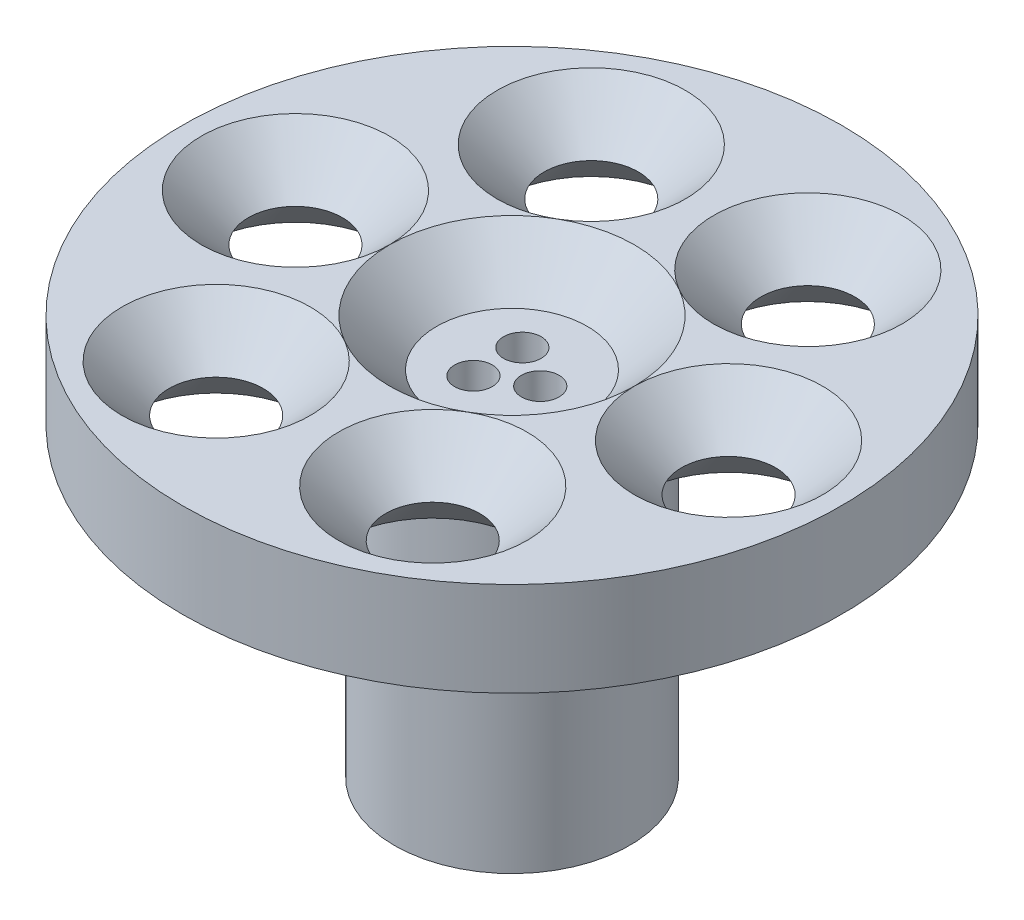
ISO-10303-21;
HEADER;
FILE_DESCRIPTION(('STEP AP214'),'2;1');
FILE_NAME('part.step','',(''),(''),'','','');
FILE_SCHEMA(('AUTOMOTIVE_DESIGN { 1 0 10303 214 1 1 1 1 }'));
ENDSEC;
DATA;
#1=APPLICATION_CONTEXT('core data for automotive mechanical design processes');
#2=APPLICATION_PROTOCOL_DEFINITION('international standard','automotive_design',2000,#1);
#3=PRODUCT_CONTEXT('',#1,'mechanical');
#4=PRODUCT('Part','Part','',(#3));
#5=PRODUCT_RELATED_PRODUCT_CATEGORY('part','',(#4));
#6=PRODUCT_DEFINITION_FORMATION('','',#4);
#7=PRODUCT_DEFINITION_CONTEXT('part definition',#1,'design');
#8=PRODUCT_DEFINITION('design','',#6,#7);
#9=PRODUCT_DEFINITION_SHAPE('','',#8);
#10=(LENGTH_UNIT() NAMED_UNIT(*) SI_UNIT(.MILLI.,.METRE.));
#11=(NAMED_UNIT(*) PLANE_ANGLE_UNIT() SI_UNIT($,.RADIAN.));
#12=(NAMED_UNIT(*) SI_UNIT($,.STERADIAN.) SOLID_ANGLE_UNIT());
#13=UNCERTAINTY_MEASURE_WITH_UNIT(LENGTH_MEASURE(1.E-05),#10,'distance_accuracy_value','');
#14=(GEOMETRIC_REPRESENTATION_CONTEXT(3) GLOBAL_UNCERTAINTY_ASSIGNED_CONTEXT((#13)) GLOBAL_UNIT_ASSIGNED_CONTEXT((#10,
#11,#12)) REPRESENTATION_CONTEXT('',''));
#15=CARTESIAN_POINT('',(0.,0.,0.));
#16=DIRECTION('',(0.,0.,1.));
#17=DIRECTION('',(1.,0.,0.));
#18=AXIS2_PLACEMENT_3D('',#15,#16,#17);
#19=CARTESIAN_POINT('',(-1.50000000000001,42.5,2.59807621135331));
#20=DIRECTION('',(0.,-1.,0.));
#21=DIRECTION('',(0.,0.,-1.));
#22=AXIS2_PLACEMENT_3D('',#19,#20,#21);
#23=CYLINDRICAL_SURFACE('',#22,2.);
#24=CARTESIAN_POINT('',(-1.50000000000001,1.5,2.59807621135331));
#25=DIRECTION('',(0.,-1.,0.));
#26=DIRECTION('',(0.,0.,-1.));
#27=AXIS2_PLACEMENT_3D('',#24,#25,#26);
#28=CIRCLE('',#27,2.);
#29=CARTESIAN_POINT('',(-1.50000000000001,1.5,0.598076211353308));
#30=VERTEX_POINT('',#29);
#31=EDGE_CURVE('E154',#30,#30,#28,.T.);
#32=ORIENTED_EDGE('',*,*,#31,.T.);
#33=EDGE_LOOP('',(#32));
#34=FACE_BOUND('',#33,.T.);
#35=CARTESIAN_POINT('',(-1.50000000000001,37.5,2.59807621135331));
#36=DIRECTION('',(0.,1.,0.));
#37=DIRECTION('',(0.,0.,1.));
#38=AXIS2_PLACEMENT_3D('',#35,#36,#37);
#39=CIRCLE('',#38,2.);
#40=CARTESIAN_POINT('',(-1.50000000000001,37.5,4.59807621135331));
#41=VERTEX_POINT('',#40);
#42=EDGE_CURVE('E130',#41,#41,#39,.F.);
#43=ORIENTED_EDGE('',*,*,#42,.F.);
#44=EDGE_LOOP('',(#43));
#45=FACE_BOUND('',#44,.T.);
#46=ADVANCED_FACE('F40',(#34,#45),#23,.F.);
#47=CARTESIAN_POINT('',(3.,42.5,0.));
#48=DIRECTION('',(0.,-1.,0.));
#49=DIRECTION('',(0.,0.,-1.));
#50=AXIS2_PLACEMENT_3D('',#47,#48,#49);
#51=CYLINDRICAL_SURFACE('',#50,2.);
#52=CARTESIAN_POINT('',(3.,1.5,0.));
#53=DIRECTION('',(0.,-1.,0.));
#54=DIRECTION('',(0.,0.,-1.));
#55=AXIS2_PLACEMENT_3D('',#52,#53,#54);
#56=CIRCLE('',#55,2.);
#57=CARTESIAN_POINT('',(3.,1.5,-2.));
#58=VERTEX_POINT('',#57);
#59=EDGE_CURVE('E151',#58,#58,#56,.T.);
#60=ORIENTED_EDGE('',*,*,#59,.T.);
#61=EDGE_LOOP('',(#60));
#62=FACE_BOUND('',#61,.T.);
#63=CARTESIAN_POINT('',(3.,37.5,0.));
#64=DIRECTION('',(0.,1.,0.));
#65=DIRECTION('',(0.,0.,1.));
#66=AXIS2_PLACEMENT_3D('',#63,#64,#65);
#67=CIRCLE('',#66,2.);
#68=CARTESIAN_POINT('',(3.,37.5,2.));
#69=VERTEX_POINT('',#68);
#70=EDGE_CURVE('E126',#69,#69,#67,.F.);
#71=ORIENTED_EDGE('',*,*,#70,.F.);
#72=EDGE_LOOP('',(#71));
#73=FACE_BOUND('',#72,.T.);
#74=ADVANCED_FACE('F204',(#62,#73),#51,.F.);
#75=CARTESIAN_POINT('',(-1.49999999999998,42.5,-2.59807621135333));
#76=DIRECTION('',(0.,-1.,0.));
#77=DIRECTION('',(0.,0.,-1.));
#78=AXIS2_PLACEMENT_3D('',#75,#76,#77);
#79=CYLINDRICAL_SURFACE('',#78,2.);
#80=CARTESIAN_POINT('',(-1.49999999999998,1.5,-2.59807621135333));
#81=DIRECTION('',(0.,-1.,0.));
#82=DIRECTION('',(0.,0.,-1.));
#83=AXIS2_PLACEMENT_3D('',#80,#81,#82);
#84=CIRCLE('',#83,2.);
#85=CARTESIAN_POINT('',(-1.49999999999998,1.5,-4.59807621135333));
#86=VERTEX_POINT('',#85);
#87=EDGE_CURVE('E148',#86,#86,#84,.T.);
#88=ORIENTED_EDGE('',*,*,#87,.T.);
#89=EDGE_LOOP('',(#88));
#90=FACE_BOUND('',#89,.T.);
#91=CARTESIAN_POINT('',(-1.49999999999998,37.5,-2.59807621135333));
#92=DIRECTION('',(0.,1.,0.));
#93=DIRECTION('',(0.,0.,1.));
#94=AXIS2_PLACEMENT_3D('',#91,#92,#93);
#95=CIRCLE('',#94,2.);
#96=CARTESIAN_POINT('',(-1.49999999999998,37.5,-0.59807621135333));
#97=VERTEX_POINT('',#96);
#98=EDGE_CURVE('E135',#97,#97,#95,.F.);
#99=ORIENTED_EDGE('',*,*,#98,.F.);
#100=EDGE_LOOP('',(#99));
#101=FACE_BOUND('',#100,.T.);
#102=ADVANCED_FACE('F210',(#90,#101),#79,.F.);
#103=CARTESIAN_POINT('',(0.,42.5,0.));
#104=DIRECTION('',(0.,-1.,0.));
#105=DIRECTION('',(0.,0.,-1.));
#106=AXIS2_PLACEMENT_3D('',#103,#104,#105);
#107=CYLINDRICAL_SURFACE('',#106,12.5);
#108=CARTESIAN_POINT('',(0.,0.,0.));
#109=DIRECTION('',(0.,1.,0.));
#110=DIRECTION('',(0.,0.,1.));
#111=AXIS2_PLACEMENT_3D('',#108,#109,#110);
#112=CIRCLE('',#111,12.5);
#113=CARTESIAN_POINT('',(0.,0.,12.5));
#114=VERTEX_POINT('',#113);
#115=EDGE_CURVE('E157',#114,#114,#112,.T.);
#116=ORIENTED_EDGE('',*,*,#115,.T.);
#117=EDGE_LOOP('',(#116));
#118=FACE_BOUND('',#117,.T.);
#119=CARTESIAN_POINT('',(0.,32.5,0.));
#120=DIRECTION('',(0.,1.,0.));
#121=DIRECTION('',(0.,0.,1.));
#122=AXIS2_PLACEMENT_3D('',#119,#120,#121);
#123=CIRCLE('',#122,12.5);
#124=CARTESIAN_POINT('',(0.,32.5,12.5));
#125=VERTEX_POINT('',#124);
#126=EDGE_CURVE('E160',#125,#125,#123,.T.);
#127=ORIENTED_EDGE('',*,*,#126,.F.);
#128=EDGE_LOOP('',(#127));
#129=FACE_BOUND('',#128,.T.);
#130=ADVANCED_FACE('F215',(#118,#129),#107,.T.);
#131=CARTESIAN_POINT('',(0.,42.5,0.));
#132=DIRECTION('',(0.,1.,0.));
#133=DIRECTION('',(0.,0.,1.));
#134=AXIS2_PLACEMENT_3D('',#131,#132,#133);
#135=PLANE('',#134);
#136=CARTESIAN_POINT('',(-11.5,42.5,19.9185842870421));
#137=DIRECTION('',(0.,1.,0.));
#138=DIRECTION('',(0.,0.,1.));
#139=AXIS2_PLACEMENT_3D('',#136,#137,#138);
#140=CIRCLE('',#139,10.);
#141=CARTESIAN_POINT('',(-6.49999999999998,42.5,11.2583302491977));
#142=VERTEX_POINT('',#141);
#143=EDGE_CURVE('E78',#142,#142,#140,.F.);
#144=ORIENTED_EDGE('',*,*,#143,.T.);
#145=CARTESIAN_POINT('',(0.,42.5,0.));
#146=DIRECTION('',(0.,1.,0.));
#147=DIRECTION('',(0.,0.,1.));
#148=AXIS2_PLACEMENT_3D('',#145,#146,#147);
#149=CIRCLE('',#148,13.);
#150=CARTESIAN_POINT('',(-13.,42.5,0.));
#151=VERTEX_POINT('',#150);
#152=EDGE_CURVE('E11',#142,#151,#149,.F.);
#153=ORIENTED_EDGE('',*,*,#152,.T.);
#154=CARTESIAN_POINT('',(-23.,42.5,0.));
#155=DIRECTION('',(0.,1.,0.));
#156=DIRECTION('',(0.,0.,1.));
#157=AXIS2_PLACEMENT_3D('',#154,#155,#156);
#158=CIRCLE('',#157,10.);
#159=EDGE_CURVE('E183',#151,#151,#158,.F.);
#160=ORIENTED_EDGE('',*,*,#159,.T.);
#161=CARTESIAN_POINT('',(0.,42.5,0.));
#162=DIRECTION('',(0.,1.,0.));
#163=DIRECTION('',(0.,0.,1.));
#164=AXIS2_PLACEMENT_3D('',#161,#162,#163);
#165=CIRCLE('',#164,13.);
#166=CARTESIAN_POINT('',(-6.5,42.5,-11.2583302491977));
#167=VERTEX_POINT('',#166);
#168=EDGE_CURVE('E49',#151,#167,#165,.F.);
#169=ORIENTED_EDGE('',*,*,#168,.T.);
#170=CARTESIAN_POINT('',(-11.5,42.5,-19.9185842870421));
#171=DIRECTION('',(0.,1.,0.));
#172=DIRECTION('',(0.,0.,1.));
#173=AXIS2_PLACEMENT_3D('',#170,#171,#172);
#174=CIRCLE('',#173,10.);
#175=EDGE_CURVE('E97',#167,#167,#174,.F.);
#176=ORIENTED_EDGE('',*,*,#175,.T.);
#177=CARTESIAN_POINT('',(0.,42.5,0.));
#178=DIRECTION('',(0.,1.,0.));
#179=DIRECTION('',(0.,0.,1.));
#180=AXIS2_PLACEMENT_3D('',#177,#178,#179);
#181=CIRCLE('',#180,13.);
#182=CARTESIAN_POINT('',(6.49999999999999,42.5,-11.2583302491977));
#183=VERTEX_POINT('',#182);
#184=EDGE_CURVE('E92',#167,#183,#181,.F.);
#185=ORIENTED_EDGE('',*,*,#184,.T.);
#186=CARTESIAN_POINT('',(11.5,42.5,-19.9185842870421));
#187=DIRECTION('',(0.,1.,0.));
#188=DIRECTION('',(0.,0.,1.));
#189=AXIS2_PLACEMENT_3D('',#186,#187,#188);
#190=CIRCLE('',#189,10.);
#191=EDGE_CURVE('E95',#183,#183,#190,.F.);
#192=ORIENTED_EDGE('',*,*,#191,.T.);
#193=CARTESIAN_POINT('',(0.,42.5,0.));
#194=DIRECTION('',(0.,1.,0.));
#195=DIRECTION('',(0.,0.,1.));
#196=AXIS2_PLACEMENT_3D('',#193,#194,#195);
#197=CIRCLE('',#196,13.);
#198=CARTESIAN_POINT('',(13.,42.5,0.));
#199=VERTEX_POINT('',#198);
#200=EDGE_CURVE('E84',#183,#199,#197,.F.);
#201=ORIENTED_EDGE('',*,*,#200,.T.);
#202=CARTESIAN_POINT('',(23.,42.5,0.));
#203=DIRECTION('',(0.,1.,0.));
#204=DIRECTION('',(0.,0.,1.));
#205=AXIS2_PLACEMENT_3D('',#202,#203,#204);
#206=CIRCLE('',#205,10.);
#207=EDGE_CURVE('E102',#199,#199,#206,.F.);
#208=ORIENTED_EDGE('',*,*,#207,.T.);
#209=CARTESIAN_POINT('',(0.,42.5,0.));
#210=DIRECTION('',(0.,1.,0.));
#211=DIRECTION('',(0.,0.,1.));
#212=AXIS2_PLACEMENT_3D('',#209,#210,#211);
#213=CIRCLE('',#212,13.);
#214=CARTESIAN_POINT('',(6.5,42.5,11.2583302491977));
#215=VERTEX_POINT('',#214);
#216=EDGE_CURVE('E82',#199,#215,#213,.F.);
#217=ORIENTED_EDGE('',*,*,#216,.T.);
#218=CARTESIAN_POINT('',(11.5,42.5,19.9185842870421));
#219=DIRECTION('',(0.,1.,0.));
#220=DIRECTION('',(0.,0.,1.));
#221=AXIS2_PLACEMENT_3D('',#218,#219,#220);
#222=CIRCLE('',#221,10.);
#223=EDGE_CURVE('E80',#215,#215,#222,.F.);
#224=ORIENTED_EDGE('',*,*,#223,.T.);
#225=CARTESIAN_POINT('',(0.,42.5,0.));
#226=DIRECTION('',(0.,1.,0.));
#227=DIRECTION('',(0.,0.,1.));
#228=AXIS2_PLACEMENT_3D('',#225,#226,#227);
#229=CIRCLE('',#228,13.);
#230=EDGE_CURVE('E74',#215,#142,#229,.F.);
#231=ORIENTED_EDGE('',*,*,#230,.T.);
#232=EDGE_LOOP('',(#144,#153,#160,#169,#176,#185,#192,#201,#208,#217,#224,#231));
#233=FACE_BOUND('',#232,.T.);
#234=CARTESIAN_POINT('',(0.,42.5,0.));
#235=DIRECTION('',(0.,1.,0.));
#236=DIRECTION('',(0.,0.,1.));
#237=AXIS2_PLACEMENT_3D('',#234,#235,#236);
#238=CIRCLE('',#237,35.);
#239=CARTESIAN_POINT('',(0.,42.5,35.));
#240=VERTEX_POINT('',#239);
#241=EDGE_CURVE('E112',#240,#240,#238,.T.);
#242=ORIENTED_EDGE('',*,*,#241,.T.);
#243=EDGE_LOOP('',(#242));
#244=FACE_BOUND('',#243,.T.);
#245=ADVANCED_FACE('F75',(#233,#244),#135,.T.);
#246=CARTESIAN_POINT('',(0.,0.,0.));
#247=DIRECTION('',(0.,1.,0.));
#248=DIRECTION('',(0.,0.,1.));
#249=AXIS2_PLACEMENT_3D('',#246,#247,#248);
#250=PLANE('',#249);
#251=CARTESIAN_POINT('',(0.,0.,0.));
#252=DIRECTION('',(0.,-1.,0.));
#253=DIRECTION('',(0.,0.,-1.));
#254=AXIS2_PLACEMENT_3D('',#251,#252,#253);
#255=CIRCLE('',#254,5.5);
#256=CARTESIAN_POINT('',(0.,0.,-5.5));
#257=VERTEX_POINT('',#256);
#258=EDGE_CURVE('E142',#257,#257,#255,.T.);
#259=ORIENTED_EDGE('',*,*,#258,.F.);
#260=EDGE_LOOP('',(#259));
#261=FACE_BOUND('',#260,.T.);
#262=ORIENTED_EDGE('',*,*,#115,.F.);
#263=EDGE_LOOP('',(#262));
#264=FACE_BOUND('',#263,.T.);
#265=ADVANCED_FACE('F312',(#261,#264),#250,.F.);
#266=CARTESIAN_POINT('',(0.,1.5,0.));
#267=DIRECTION('',(0.,-1.,0.));
#268=DIRECTION('',(0.,0.,-1.));
#269=AXIS2_PLACEMENT_3D('',#266,#267,#268);
#270=CYLINDRICAL_SURFACE('',#269,5.5);
#271=CARTESIAN_POINT('',(0.,1.5,0.));
#272=DIRECTION('',(0.,-1.,0.));
#273=DIRECTION('',(0.,0.,-1.));
#274=AXIS2_PLACEMENT_3D('',#271,#272,#273);
#275=CIRCLE('',#274,5.5);
#276=CARTESIAN_POINT('',(0.,1.5,-5.5));
#277=VERTEX_POINT('',#276);
#278=EDGE_CURVE('E145',#277,#277,#275,.T.);
#279=ORIENTED_EDGE('',*,*,#278,.F.);
#280=EDGE_LOOP('',(#279));
#281=FACE_BOUND('',#280,.T.);
#282=ORIENTED_EDGE('',*,*,#258,.T.);
#283=EDGE_LOOP('',(#282));
#284=FACE_BOUND('',#283,.T.);
#285=ADVANCED_FACE('F318',(#281,#284),#270,.F.);
#286=CARTESIAN_POINT('',(0.,1.5,0.));
#287=DIRECTION('',(0.,-1.,0.));
#288=DIRECTION('',(0.,0.,-1.));
#289=AXIS2_PLACEMENT_3D('',#286,#287,#288);
#290=PLANE('',#289);
#291=ORIENTED_EDGE('',*,*,#31,.F.);
#292=EDGE_LOOP('',(#291));
#293=FACE_BOUND('',#292,.T.);
#294=ORIENTED_EDGE('',*,*,#59,.F.);
#295=EDGE_LOOP('',(#294));
#296=FACE_BOUND('',#295,.T.);
#297=ORIENTED_EDGE('',*,*,#87,.F.);
#298=EDGE_LOOP('',(#297));
#299=FACE_BOUND('',#298,.T.);
#300=ORIENTED_EDGE('',*,*,#278,.T.);
#301=EDGE_LOOP('',(#300));
#302=FACE_BOUND('',#301,.T.);
#303=ADVANCED_FACE('F308',(#293,#296,#299,#302),#290,.T.);
#304=CARTESIAN_POINT('',(0.,32.5,0.));
#305=DIRECTION('',(0.,1.,0.));
#306=DIRECTION('',(0.,0.,1.));
#307=AXIS2_PLACEMENT_3D('',#304,#305,#306);
#308=CYLINDRICAL_SURFACE('',#307,35.);
#309=CARTESIAN_POINT('',(0.,32.5,0.));
#310=DIRECTION('',(0.,1.,0.));
#311=DIRECTION('',(0.,0.,1.));
#312=AXIS2_PLACEMENT_3D('',#309,#310,#311);
#313=CIRCLE('',#312,35.);
#314=CARTESIAN_POINT('',(0.,32.5,35.));
#315=VERTEX_POINT('',#314);
#316=EDGE_CURVE('E139',#315,#315,#313,.T.);
#317=ORIENTED_EDGE('',*,*,#316,.T.);
#318=EDGE_LOOP('',(#317));
#319=FACE_BOUND('',#318,.T.);
#320=ORIENTED_EDGE('',*,*,#241,.F.);
#321=EDGE_LOOP('',(#320));
#322=FACE_BOUND('',#321,.T.);
#323=ADVANCED_FACE('F299',(#319,#322),#308,.T.);
#324=CARTESIAN_POINT('',(0.,32.5,0.));
#325=DIRECTION('',(0.,1.,0.));
#326=DIRECTION('',(0.,0.,1.));
#327=AXIS2_PLACEMENT_3D('',#324,#325,#326);
#328=PLANE('',#327);
#329=CARTESIAN_POINT('',(11.5,32.5,19.9185842870421));
#330=DIRECTION('',(0.,1.,0.));
#331=DIRECTION('',(0.,0.,1.));
#332=AXIS2_PLACEMENT_3D('',#329,#330,#331);
#333=CIRCLE('',#332,10.);
#334=CARTESIAN_POINT('',(11.5,32.5,29.9185842870421));
#335=VERTEX_POINT('',#334);
#336=EDGE_CURVE('E180',#335,#335,#333,.T.);
#337=ORIENTED_EDGE('',*,*,#336,.T.);
#338=EDGE_LOOP('',(#337));
#339=FACE_BOUND('',#338,.T.);
#340=CARTESIAN_POINT('',(23.,32.5,0.));
#341=DIRECTION('',(0.,1.,0.));
#342=DIRECTION('',(0.,0.,1.));
#343=AXIS2_PLACEMENT_3D('',#340,#341,#342);
#344=CIRCLE('',#343,10.);
#345=CARTESIAN_POINT('',(23.,32.5,10.));
#346=VERTEX_POINT('',#345);
#347=EDGE_CURVE('E177',#346,#346,#344,.T.);
#348=ORIENTED_EDGE('',*,*,#347,.T.);
#349=EDGE_LOOP('',(#348));
#350=FACE_BOUND('',#349,.T.);
#351=CARTESIAN_POINT('',(11.5,32.5,-19.9185842870421));
#352=DIRECTION('',(0.,1.,0.));
#353=DIRECTION('',(0.,0.,1.));
#354=AXIS2_PLACEMENT_3D('',#351,#352,#353);
#355=CIRCLE('',#354,10.);
#356=CARTESIAN_POINT('',(11.5,32.5,-9.91858428704209));
#357=VERTEX_POINT('',#356);
#358=EDGE_CURVE('E174',#357,#357,#355,.T.);
#359=ORIENTED_EDGE('',*,*,#358,.T.);
#360=EDGE_LOOP('',(#359));
#361=FACE_BOUND('',#360,.T.);
#362=CARTESIAN_POINT('',(-11.5,32.5,-19.9185842870421));
#363=DIRECTION('',(0.,1.,0.));
#364=DIRECTION('',(0.,0.,1.));
#365=AXIS2_PLACEMENT_3D('',#362,#363,#364);
#366=CIRCLE('',#365,10.);
#367=CARTESIAN_POINT('',(-11.5,32.5,-9.91858428704208));
#368=VERTEX_POINT('',#367);
#369=EDGE_CURVE('E171',#368,#368,#366,.T.);
#370=ORIENTED_EDGE('',*,*,#369,.T.);
#371=EDGE_LOOP('',(#370));
#372=FACE_BOUND('',#371,.T.);
#373=CARTESIAN_POINT('',(-23.,32.5,0.));
#374=DIRECTION('',(0.,1.,0.));
#375=DIRECTION('',(0.,0.,1.));
#376=AXIS2_PLACEMENT_3D('',#373,#374,#375);
#377=CIRCLE('',#376,10.);
#378=CARTESIAN_POINT('',(-23.,32.5,10.));
#379=VERTEX_POINT('',#378);
#380=EDGE_CURVE('E168',#379,#379,#377,.T.);
#381=ORIENTED_EDGE('',*,*,#380,.T.);
#382=EDGE_LOOP('',(#381));
#383=FACE_BOUND('',#382,.T.);
#384=CARTESIAN_POINT('',(-11.5,32.5,19.9185842870421));
#385=DIRECTION('',(0.,1.,0.));
#386=DIRECTION('',(0.,0.,1.));
#387=AXIS2_PLACEMENT_3D('',#384,#385,#386);
#388=CIRCLE('',#387,10.);
#389=CARTESIAN_POINT('',(-11.5,32.5,29.9185842870421));
#390=VERTEX_POINT('',#389);
#391=EDGE_CURVE('E165',#390,#390,#388,.T.);
#392=ORIENTED_EDGE('',*,*,#391,.T.);
#393=EDGE_LOOP('',(#392));
#394=FACE_BOUND('',#393,.T.);
#395=ORIENTED_EDGE('',*,*,#126,.T.);
#396=EDGE_LOOP('',(#395));
#397=FACE_BOUND('',#396,.T.);
#398=ORIENTED_EDGE('',*,*,#316,.F.);
#399=EDGE_LOOP('',(#398));
#400=FACE_BOUND('',#399,.T.);
#401=ADVANCED_FACE('F236',(#339,#350,#361,#372,#383,#394,#397,#400),#328,.F.);
#402=CARTESIAN_POINT('',(11.5,37.5,19.9185842870421));
#403=DIRECTION('',(0.,1.,0.));
#404=DIRECTION('',(0.,0.,1.));
#405=AXIS2_PLACEMENT_3D('',#402,#403,#404);
#406=CONICAL_SURFACE('',#405,5.,0.785398163397451);
#407=ORIENTED_EDGE('',*,*,#223,.F.);
#408=EDGE_LOOP('',(#407));
#409=FACE_BOUND('',#408,.T.);
#410=CARTESIAN_POINT('',(11.5,37.5,19.9185842870421));
#411=DIRECTION('',(0.,1.,0.));
#412=DIRECTION('',(0.,0.,1.));
#413=AXIS2_PLACEMENT_3D('',#410,#411,#412);
#414=CIRCLE('',#413,5.);
#415=CARTESIAN_POINT('',(11.5,37.5,24.9185842870421));
#416=VERTEX_POINT('',#415);
#417=EDGE_CURVE('E109',#416,#416,#414,.T.);
#418=ORIENTED_EDGE('',*,*,#417,.F.);
#419=EDGE_LOOP('',(#418));
#420=FACE_BOUND('',#419,.T.);
#421=ADVANCED_FACE('F230',(#409,#420),#406,.F.);
#422=CARTESIAN_POINT('',(11.5,32.5,19.9185842870421));
#423=DIRECTION('',(0.,-1.,0.));
#424=DIRECTION('',(0.,0.,-1.));
#425=AXIS2_PLACEMENT_3D('',#422,#423,#424);
#426=CONICAL_SURFACE('',#425,10.,0.785398163397447);
#427=ORIENTED_EDGE('',*,*,#417,.T.);
#428=EDGE_LOOP('',(#427));
#429=FACE_BOUND('',#428,.T.);
#430=ORIENTED_EDGE('',*,*,#336,.F.);
#431=EDGE_LOOP('',(#430));
#432=FACE_BOUND('',#431,.T.);
#433=ADVANCED_FACE('F222',(#429,#432),#426,.F.);
#434=CARTESIAN_POINT('',(23.,37.5,0.));
#435=DIRECTION('',(0.,1.,0.));
#436=DIRECTION('',(0.,0.,1.));
#437=AXIS2_PLACEMENT_3D('',#434,#435,#436);
#438=CONICAL_SURFACE('',#437,5.,0.785398163397451);
#439=ORIENTED_EDGE('',*,*,#207,.F.);
#440=EDGE_LOOP('',(#439));
#441=FACE_BOUND('',#440,.T.);
#442=CARTESIAN_POINT('',(23.,37.5,0.));
#443=DIRECTION('',(0.,1.,0.));
#444=DIRECTION('',(0.,0.,1.));
#445=AXIS2_PLACEMENT_3D('',#442,#443,#444);
#446=CIRCLE('',#445,5.);
#447=CARTESIAN_POINT('',(23.,37.5,5.));
#448=VERTEX_POINT('',#447);
#449=EDGE_CURVE('E113',#448,#448,#446,.T.);
#450=ORIENTED_EDGE('',*,*,#449,.F.);
#451=EDGE_LOOP('',(#450));
#452=FACE_BOUND('',#451,.T.);
#453=ADVANCED_FACE('F229',(#441,#452),#438,.F.);
#454=CARTESIAN_POINT('',(23.,32.5,0.));
#455=DIRECTION('',(0.,-1.,0.));
#456=DIRECTION('',(0.,0.,-1.));
#457=AXIS2_PLACEMENT_3D('',#454,#455,#456);
#458=CONICAL_SURFACE('',#457,10.,0.785398163397447);
#459=ORIENTED_EDGE('',*,*,#449,.T.);
#460=EDGE_LOOP('',(#459));
#461=FACE_BOUND('',#460,.T.);
#462=ORIENTED_EDGE('',*,*,#347,.F.);
#463=EDGE_LOOP('',(#462));
#464=FACE_BOUND('',#463,.T.);
#465=ADVANCED_FACE('F239',(#461,#464),#458,.F.);
#466=CARTESIAN_POINT('',(11.5,37.5,-19.9185842870421));
#467=DIRECTION('',(0.,1.,0.));
#468=DIRECTION('',(0.,0.,1.));
#469=AXIS2_PLACEMENT_3D('',#466,#467,#468);
#470=CONICAL_SURFACE('',#469,5.,0.785398163397451);
#471=ORIENTED_EDGE('',*,*,#191,.F.);
#472=EDGE_LOOP('',(#471));
#473=FACE_BOUND('',#472,.T.);
#474=CARTESIAN_POINT('',(11.5,37.5,-19.9185842870421));
#475=DIRECTION('',(0.,1.,0.));
#476=DIRECTION('',(0.,0.,1.));
#477=AXIS2_PLACEMENT_3D('',#474,#475,#476);
#478=CIRCLE('',#477,5.);
#479=CARTESIAN_POINT('',(11.5,37.5,-14.9185842870421));
#480=VERTEX_POINT('',#479);
#481=EDGE_CURVE('E116',#480,#480,#478,.T.);
#482=ORIENTED_EDGE('',*,*,#481,.F.);
#483=EDGE_LOOP('',(#482));
#484=FACE_BOUND('',#483,.T.);
#485=ADVANCED_FACE('F245',(#473,#484),#470,.F.);
#486=CARTESIAN_POINT('',(11.5,32.5,-19.9185842870421));
#487=DIRECTION('',(0.,-1.,0.));
#488=DIRECTION('',(0.,0.,-1.));
#489=AXIS2_PLACEMENT_3D('',#486,#487,#488);
#490=CONICAL_SURFACE('',#489,10.,0.785398163397447);
#491=ORIENTED_EDGE('',*,*,#481,.T.);
#492=EDGE_LOOP('',(#491));
#493=FACE_BOUND('',#492,.T.);
#494=ORIENTED_EDGE('',*,*,#358,.F.);
#495=EDGE_LOOP('',(#494));
#496=FACE_BOUND('',#495,.T.);
#497=ADVANCED_FACE('F252',(#493,#496),#490,.F.);
#498=CARTESIAN_POINT('',(-11.5,37.5,-19.9185842870421));
#499=DIRECTION('',(0.,1.,0.));
#500=DIRECTION('',(0.,0.,1.));
#501=AXIS2_PLACEMENT_3D('',#498,#499,#500);
#502=CONICAL_SURFACE('',#501,5.,0.785398163397451);
#503=ORIENTED_EDGE('',*,*,#175,.F.);
#504=EDGE_LOOP('',(#503));
#505=FACE_BOUND('',#504,.T.);
#506=CARTESIAN_POINT('',(-11.5,37.5,-19.9185842870421));
#507=DIRECTION('',(0.,1.,0.));
#508=DIRECTION('',(0.,0.,1.));
#509=AXIS2_PLACEMENT_3D('',#506,#507,#508);
#510=CIRCLE('',#509,5.);
#511=CARTESIAN_POINT('',(-11.5,37.5,-14.9185842870421));
#512=VERTEX_POINT('',#511);
#513=EDGE_CURVE('E119',#512,#512,#510,.T.);
#514=ORIENTED_EDGE('',*,*,#513,.F.);
#515=EDGE_LOOP('',(#514));
#516=FACE_BOUND('',#515,.T.);
#517=ADVANCED_FACE('F198',(#505,#516),#502,.F.);
#518=CARTESIAN_POINT('',(-11.5,32.5,-19.9185842870421));
#519=DIRECTION('',(0.,-1.,0.));
#520=DIRECTION('',(0.,0.,-1.));
#521=AXIS2_PLACEMENT_3D('',#518,#519,#520);
#522=CONICAL_SURFACE('',#521,10.,0.785398163397447);
#523=ORIENTED_EDGE('',*,*,#513,.T.);
#524=EDGE_LOOP('',(#523));
#525=FACE_BOUND('',#524,.T.);
#526=ORIENTED_EDGE('',*,*,#369,.F.);
#527=EDGE_LOOP('',(#526));
#528=FACE_BOUND('',#527,.T.);
#529=ADVANCED_FACE('F190',(#525,#528),#522,.F.);
#530=CARTESIAN_POINT('',(-23.,37.5,0.));
#531=DIRECTION('',(0.,1.,0.));
#532=DIRECTION('',(0.,0.,1.));
#533=AXIS2_PLACEMENT_3D('',#530,#531,#532);
#534=CONICAL_SURFACE('',#533,5.,0.785398163397451);
#535=ORIENTED_EDGE('',*,*,#159,.F.);
#536=EDGE_LOOP('',(#535));
#537=FACE_BOUND('',#536,.T.);
#538=CARTESIAN_POINT('',(-23.,37.5,0.));
#539=DIRECTION('',(0.,1.,0.));
#540=DIRECTION('',(0.,0.,1.));
#541=AXIS2_PLACEMENT_3D('',#538,#539,#540);
#542=CIRCLE('',#541,5.);
#543=CARTESIAN_POINT('',(-23.,37.5,5.));
#544=VERTEX_POINT('',#543);
#545=EDGE_CURVE('E121',#544,#544,#542,.T.);
#546=ORIENTED_EDGE('',*,*,#545,.F.);
#547=EDGE_LOOP('',(#546));
#548=FACE_BOUND('',#547,.T.);
#549=ADVANCED_FACE('F186',(#537,#548),#534,.F.);
#550=CARTESIAN_POINT('',(-23.,32.5,0.));
#551=DIRECTION('',(0.,-1.,0.));
#552=DIRECTION('',(0.,0.,-1.));
#553=AXIS2_PLACEMENT_3D('',#550,#551,#552);
#554=CONICAL_SURFACE('',#553,10.,0.785398163397447);
#555=ORIENTED_EDGE('',*,*,#545,.T.);
#556=EDGE_LOOP('',(#555));
#557=FACE_BOUND('',#556,.T.);
#558=ORIENTED_EDGE('',*,*,#380,.F.);
#559=EDGE_LOOP('',(#558));
#560=FACE_BOUND('',#559,.T.);
#561=ADVANCED_FACE('F189',(#557,#560),#554,.F.);
#562=CARTESIAN_POINT('',(-11.5,37.5,19.9185842870421));
#563=DIRECTION('',(0.,1.,0.));
#564=DIRECTION('',(0.,0.,1.));
#565=AXIS2_PLACEMENT_3D('',#562,#563,#564);
#566=CONICAL_SURFACE('',#565,5.,0.785398163397451);
#567=ORIENTED_EDGE('',*,*,#143,.F.);
#568=EDGE_LOOP('',(#567));
#569=FACE_BOUND('',#568,.T.);
#570=CARTESIAN_POINT('',(-11.5,37.5,19.9185842870421));
#571=DIRECTION('',(0.,1.,0.));
#572=DIRECTION('',(0.,0.,1.));
#573=AXIS2_PLACEMENT_3D('',#570,#571,#572);
#574=CIRCLE('',#573,5.);
#575=CARTESIAN_POINT('',(-11.5,37.5,24.9185842870421));
#576=VERTEX_POINT('',#575);
#577=EDGE_CURVE('E88',#576,#576,#574,.T.);
#578=ORIENTED_EDGE('',*,*,#577,.F.);
#579=EDGE_LOOP('',(#578));
#580=FACE_BOUND('',#579,.T.);
#581=ADVANCED_FACE('F196',(#569,#580),#566,.F.);
#582=CARTESIAN_POINT('',(-11.5,32.5,19.9185842870421));
#583=DIRECTION('',(0.,-1.,0.));
#584=DIRECTION('',(0.,0.,-1.));
#585=AXIS2_PLACEMENT_3D('',#582,#583,#584);
#586=CONICAL_SURFACE('',#585,10.,0.785398163397447);
#587=ORIENTED_EDGE('',*,*,#577,.T.);
#588=EDGE_LOOP('',(#587));
#589=FACE_BOUND('',#588,.T.);
#590=ORIENTED_EDGE('',*,*,#391,.F.);
#591=EDGE_LOOP('',(#590));
#592=FACE_BOUND('',#591,.T.);
#593=ADVANCED_FACE('F282',(#589,#592),#586,.F.);
#594=CARTESIAN_POINT('',(0.,37.5,0.));
#595=DIRECTION('',(0.,1.,0.));
#596=DIRECTION('',(0.,0.,1.));
#597=AXIS2_PLACEMENT_3D('',#594,#595,#596);
#598=PLANE('',#597);
#599=CARTESIAN_POINT('',(0.,37.5,0.));
#600=DIRECTION('',(0.,1.,0.));
#601=DIRECTION('',(0.,0.,1.));
#602=AXIS2_PLACEMENT_3D('',#599,#600,#601);
#603=CIRCLE('',#602,8.);
#604=CARTESIAN_POINT('',(0.,37.5,8.));
#605=VERTEX_POINT('',#604);
#606=EDGE_CURVE('E345',#605,#605,#603,.T.);
#607=ORIENTED_EDGE('',*,*,#606,.T.);
#608=EDGE_LOOP('',(#607));
#609=FACE_BOUND('',#608,.T.);
#610=ORIENTED_EDGE('',*,*,#98,.T.);
#611=EDGE_LOOP('',(#610));
#612=FACE_BOUND('',#611,.T.);
#613=ORIENTED_EDGE('',*,*,#42,.T.);
#614=EDGE_LOOP('',(#613));
#615=FACE_BOUND('',#614,.T.);
#616=ORIENTED_EDGE('',*,*,#70,.T.);
#617=EDGE_LOOP('',(#616));
#618=FACE_BOUND('',#617,.T.);
#619=ADVANCED_FACE('F286',(#609,#612,#615,#618),#598,.T.);
#620=CARTESIAN_POINT('',(0.,37.5,0.));
#621=DIRECTION('',(0.,1.,0.));
#622=DIRECTION('',(0.,0.,1.));
#623=AXIS2_PLACEMENT_3D('',#620,#621,#622);
#624=CONICAL_SURFACE('',#623,8.,0.78539816339745);
#625=ORIENTED_EDGE('',*,*,#168,.F.);
#626=ORIENTED_EDGE('',*,*,#152,.F.);
#627=ORIENTED_EDGE('',*,*,#230,.F.);
#628=ORIENTED_EDGE('',*,*,#216,.F.);
#629=ORIENTED_EDGE('',*,*,#200,.F.);
#630=ORIENTED_EDGE('',*,*,#184,.F.);
#631=EDGE_LOOP('',(#625,#626,#627,#628,#629,#630));
#632=FACE_BOUND('',#631,.T.);
#633=ORIENTED_EDGE('',*,*,#606,.F.);
#634=EDGE_LOOP('',(#633));
#635=FACE_BOUND('',#634,.T.);
#636=ADVANCED_FACE('F43',(#632,#635),#624,.F.);
#637=CLOSED_SHELL('',(#46,#74,#102,#130,#245,#265,#285,#303,#323,#401,#421,#433,#453,#465,#485,
#497,#517,#529,#549,#561,#581,#593,#619,#636));
#638=MANIFOLD_SOLID_BREP('B2',#637);
#639=ADVANCED_BREP_SHAPE_REPRESENTATION('',(#18,#638),#14);
#640=SHAPE_DEFINITION_REPRESENTATION(#9,#639);
ENDSEC;
END-ISO-10303-21;
